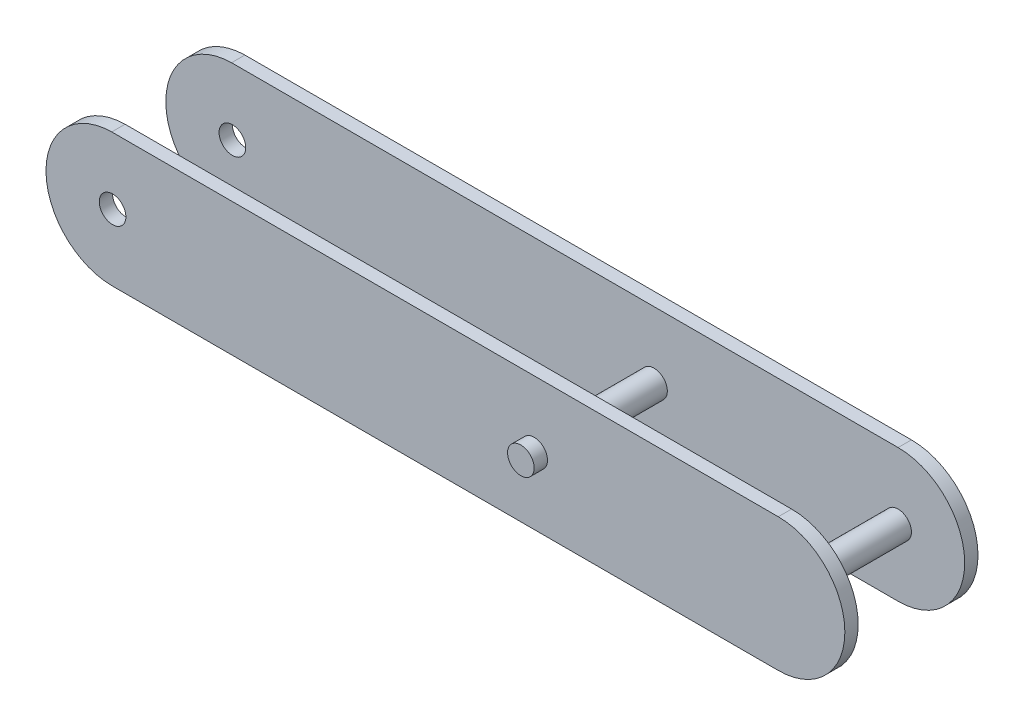
ISO-10303-21;
HEADER;
FILE_DESCRIPTION(('STEP AP214'),'2;1');
FILE_NAME('part.step','',(''),(''),'','','');
FILE_SCHEMA(('AUTOMOTIVE_DESIGN { 1 0 10303 214 1 1 1 1 }'));
ENDSEC;
DATA;
#1=APPLICATION_CONTEXT('core data for automotive mechanical design processes');
#2=APPLICATION_PROTOCOL_DEFINITION('international standard','automotive_design',2000,#1);
#3=PRODUCT_CONTEXT('',#1,'mechanical');
#4=PRODUCT('Part','Part','',(#3));
#5=PRODUCT_RELATED_PRODUCT_CATEGORY('part','',(#4));
#6=PRODUCT_DEFINITION_FORMATION('','',#4);
#7=PRODUCT_DEFINITION_CONTEXT('part definition',#1,'design');
#8=PRODUCT_DEFINITION('design','',#6,#7);
#9=PRODUCT_DEFINITION_SHAPE('','',#8);
#10=(LENGTH_UNIT() NAMED_UNIT(*) SI_UNIT(.MILLI.,.METRE.));
#11=(NAMED_UNIT(*) PLANE_ANGLE_UNIT() SI_UNIT($,.RADIAN.));
#12=(NAMED_UNIT(*) SI_UNIT($,.STERADIAN.) SOLID_ANGLE_UNIT());
#13=UNCERTAINTY_MEASURE_WITH_UNIT(LENGTH_MEASURE(1.E-05),#10,'distance_accuracy_value','');
#14=(GEOMETRIC_REPRESENTATION_CONTEXT(3) GLOBAL_UNCERTAINTY_ASSIGNED_CONTEXT((#13)) GLOBAL_UNIT_ASSIGNED_CONTEXT((#10,
#11,#12)) REPRESENTATION_CONTEXT('',''));
#15=CARTESIAN_POINT('',(0.,0.,0.));
#16=DIRECTION('',(0.,0.,1.));
#17=DIRECTION('',(1.,0.,0.));
#18=AXIS2_PLACEMENT_3D('',#15,#16,#17);
#19=CARTESIAN_POINT('',(-110.,0.,12.));
#20=DIRECTION('',(0.,0.,-1.));
#21=DIRECTION('',(-1.,0.,0.));
#22=AXIS2_PLACEMENT_3D('',#19,#20,#21);
#23=PLANE('',#22);
#24=CARTESIAN_POINT('',(55.,0.,12.));
#25=DIRECTION('',(0.,0.,-1.));
#26=DIRECTION('',(-1.,0.,0.));
#27=AXIS2_PLACEMENT_3D('',#24,#25,#26);
#28=CIRCLE('',#27,3.);
#29=CARTESIAN_POINT('',(52.,0.,12.));
#30=VERTEX_POINT('',#29);
#31=EDGE_CURVE('E11',#30,#30,#28,.T.);
#32=ORIENTED_EDGE('',*,*,#31,.F.);
#33=EDGE_LOOP('',(#32));
#34=FACE_BOUND('',#33,.T.);
#35=CARTESIAN_POINT('',(-95.,0.,12.));
#36=DIRECTION('',(0.,0.,-1.));
#37=DIRECTION('',(-1.,0.,0.));
#38=AXIS2_PLACEMENT_3D('',#35,#36,#37);
#39=CIRCLE('',#38,3.00000000000001);
#40=CARTESIAN_POINT('',(-98.,0.,12.));
#41=VERTEX_POINT('',#40);
#42=EDGE_CURVE('E145',#41,#41,#39,.T.);
#43=ORIENTED_EDGE('',*,*,#42,.F.);
#44=EDGE_LOOP('',(#43));
#45=FACE_BOUND('',#44,.T.);
#46=CARTESIAN_POINT('',(0.,0.,12.));
#47=DIRECTION('',(0.,0.,-1.));
#48=DIRECTION('',(-1.,0.,0.));
#49=AXIS2_PLACEMENT_3D('',#46,#47,#48);
#50=CIRCLE('',#49,3.);
#51=CARTESIAN_POINT('',(-3.,0.,12.));
#52=VERTEX_POINT('',#51);
#53=EDGE_CURVE('E170',#52,#52,#50,.T.);
#54=ORIENTED_EDGE('',*,*,#53,.F.);
#55=EDGE_LOOP('',(#54));
#56=FACE_BOUND('',#55,.T.);
#57=CARTESIAN_POINT('',(55.,0.,12.));
#58=DIRECTION('',(0.,0.,-1.));
#59=DIRECTION('',(-1.,0.,0.));
#60=AXIS2_PLACEMENT_3D('',#57,#58,#59);
#61=CIRCLE('',#60,15.);
#62=CARTESIAN_POINT('',(55.,15.,12.));
#63=VERTEX_POINT('',#62);
#64=CARTESIAN_POINT('',(55.,-15.,12.));
#65=VERTEX_POINT('',#64);
#66=EDGE_CURVE('E266',#63,#65,#61,.T.);
#67=ORIENTED_EDGE('',*,*,#66,.T.);
#68=DIRECTION('',(1.,0.,0.));
#69=VECTOR('',#68,1.);
#70=CARTESIAN_POINT('',(-110.,-15.,12.));
#71=LINE('',#70,#69);
#72=CARTESIAN_POINT('',(-95.1850408959753,-15.,12.));
#73=VERTEX_POINT('',#72);
#74=EDGE_CURVE('E144',#73,#65,#71,.T.);
#75=ORIENTED_EDGE('',*,*,#74,.F.);
#76=CARTESIAN_POINT('',(-95.,0.,12.));
#77=DIRECTION('',(0.,0.,-1.));
#78=DIRECTION('',(-1.,0.,0.));
#79=AXIS2_PLACEMENT_3D('',#76,#77,#78);
#80=CIRCLE('',#79,15.0011412943543);
#81=CARTESIAN_POINT('',(-110.,-0.185040895976278,12.));
#82=VERTEX_POINT('',#81);
#83=EDGE_CURVE('E235',#73,#82,#80,.T.);
#84=ORIENTED_EDGE('',*,*,#83,.T.);
#85=DIRECTION('',(0.,1.,0.));
#86=VECTOR('',#85,1.);
#87=CARTESIAN_POINT('',(-110.,0.,12.));
#88=LINE('',#87,#86);
#89=CARTESIAN_POINT('',(-110.,0.185040895976274,12.));
#90=VERTEX_POINT('',#89);
#91=EDGE_CURVE('E204',#82,#90,#88,.T.);
#92=ORIENTED_EDGE('',*,*,#91,.T.);
#93=CARTESIAN_POINT('',(-95.,0.,12.));
#94=DIRECTION('',(0.,0.,-1.));
#95=DIRECTION('',(-1.,0.,0.));
#96=AXIS2_PLACEMENT_3D('',#93,#94,#95);
#97=CIRCLE('',#96,15.0011412943543);
#98=CARTESIAN_POINT('',(-95.1850408959749,15.,12.));
#99=VERTEX_POINT('',#98);
#100=EDGE_CURVE('E223',#90,#99,#97,.T.);
#101=ORIENTED_EDGE('',*,*,#100,.T.);
#102=DIRECTION('',(1.,0.,0.));
#103=VECTOR('',#102,1.);
#104=CARTESIAN_POINT('',(-110.,15.,12.));
#105=LINE('',#104,#103);
#106=EDGE_CURVE('E155',#99,#63,#105,.T.);
#107=ORIENTED_EDGE('',*,*,#106,.T.);
#108=EDGE_LOOP('',(#67,#75,#84,#92,#101,#107));
#109=FACE_BOUND('',#108,.T.);
#110=ADVANCED_FACE('F34',(#34,#45,#56,#109),#23,.T.);
#111=CARTESIAN_POINT('',(-110.,0.,15.));
#112=DIRECTION('',(0.,0.,1.));
#113=DIRECTION('',(0.,-1.,0.));
#114=AXIS2_PLACEMENT_3D('',#111,#112,#113);
#115=PLANE('',#114);
#116=CARTESIAN_POINT('',(-95.,0.,15.));
#117=DIRECTION('',(0.,0.,1.));
#118=DIRECTION('',(1.,0.,0.));
#119=AXIS2_PLACEMENT_3D('',#116,#117,#118);
#120=CIRCLE('',#119,3.00000000000001);
#121=CARTESIAN_POINT('',(-92.,0.,15.));
#122=VERTEX_POINT('',#121);
#123=EDGE_CURVE('E277',#122,#122,#120,.T.);
#124=ORIENTED_EDGE('',*,*,#123,.F.);
#125=EDGE_LOOP('',(#124));
#126=FACE_BOUND('',#125,.T.);
#127=CARTESIAN_POINT('',(0.,0.,15.));
#128=DIRECTION('',(0.,0.,1.));
#129=DIRECTION('',(0.,-1.,0.));
#130=AXIS2_PLACEMENT_3D('',#127,#128,#129);
#131=CIRCLE('',#130,3.);
#132=CARTESIAN_POINT('',(0.,-3.,15.));
#133=VERTEX_POINT('',#132);
#134=EDGE_CURVE('E167',#133,#133,#131,.T.);
#135=ORIENTED_EDGE('',*,*,#134,.F.);
#136=EDGE_LOOP('',(#135));
#137=FACE_BOUND('',#136,.T.);
#138=DIRECTION('',(1.,0.,0.));
#139=VECTOR('',#138,1.);
#140=CARTESIAN_POINT('',(-110.,-15.,15.));
#141=LINE('',#140,#139);
#142=CARTESIAN_POINT('',(-95.1850408959753,-15.,15.));
#143=VERTEX_POINT('',#142);
#144=CARTESIAN_POINT('',(55.,-15.,15.));
#145=VERTEX_POINT('',#144);
#146=EDGE_CURVE('E142',#143,#145,#141,.T.);
#147=ORIENTED_EDGE('',*,*,#146,.T.);
#148=CARTESIAN_POINT('',(55.,0.,15.));
#149=DIRECTION('',(0.,0.,1.));
#150=DIRECTION('',(1.,0.,0.));
#151=AXIS2_PLACEMENT_3D('',#148,#149,#150);
#152=CIRCLE('',#151,15.);
#153=CARTESIAN_POINT('',(55.,15.,15.));
#154=VERTEX_POINT('',#153);
#155=EDGE_CURVE('E125',#145,#154,#152,.T.);
#156=ORIENTED_EDGE('',*,*,#155,.T.);
#157=DIRECTION('',(1.,0.,0.));
#158=VECTOR('',#157,1.);
#159=CARTESIAN_POINT('',(-110.,15.,15.));
#160=LINE('',#159,#158);
#161=CARTESIAN_POINT('',(-95.1850408959749,15.,15.));
#162=VERTEX_POINT('',#161);
#163=EDGE_CURVE('E151',#162,#154,#160,.T.);
#164=ORIENTED_EDGE('',*,*,#163,.F.);
#165=CARTESIAN_POINT('',(-95.,0.,15.));
#166=DIRECTION('',(0.,0.,1.));
#167=DIRECTION('',(1.,0.,0.));
#168=AXIS2_PLACEMENT_3D('',#165,#166,#167);
#169=CIRCLE('',#168,15.0011412943543);
#170=CARTESIAN_POINT('',(-110.,0.185040895976274,15.));
#171=VERTEX_POINT('',#170);
#172=EDGE_CURVE('E51',#162,#171,#169,.T.);
#173=ORIENTED_EDGE('',*,*,#172,.T.);
#174=DIRECTION('',(0.,-1.,0.));
#175=VECTOR('',#174,1.);
#176=CARTESIAN_POINT('',(-110.,0.,15.));
#177=LINE('',#176,#175);
#178=CARTESIAN_POINT('',(-110.,-0.185040895976278,15.));
#179=VERTEX_POINT('',#178);
#180=EDGE_CURVE('E161',#171,#179,#177,.T.);
#181=ORIENTED_EDGE('',*,*,#180,.T.);
#182=CARTESIAN_POINT('',(-95.,0.,15.));
#183=DIRECTION('',(0.,0.,1.));
#184=DIRECTION('',(1.,0.,0.));
#185=AXIS2_PLACEMENT_3D('',#182,#183,#184);
#186=CIRCLE('',#185,15.0011412943543);
#187=EDGE_CURVE('E150',#179,#143,#186,.T.);
#188=ORIENTED_EDGE('',*,*,#187,.T.);
#189=EDGE_LOOP('',(#147,#156,#164,#173,#181,#188));
#190=FACE_BOUND('',#189,.T.);
#191=ADVANCED_FACE('F148',(#126,#137,#190),#115,.T.);
#192=CARTESIAN_POINT('',(-110.,0.,-12.));
#193=DIRECTION('',(0.,0.,-1.));
#194=DIRECTION('',(-1.,0.,0.));
#195=AXIS2_PLACEMENT_3D('',#192,#193,#194);
#196=PLANE('',#195);
#197=CARTESIAN_POINT('',(55.,0.,-12.));
#198=DIRECTION('',(0.,0.,-1.));
#199=DIRECTION('',(-1.,0.,0.));
#200=AXIS2_PLACEMENT_3D('',#197,#198,#199);
#201=CIRCLE('',#200,3.);
#202=CARTESIAN_POINT('',(52.,0.,-12.));
#203=VERTEX_POINT('',#202);
#204=EDGE_CURVE('E279',#203,#203,#201,.T.);
#205=ORIENTED_EDGE('',*,*,#204,.T.);
#206=EDGE_LOOP('',(#205));
#207=FACE_BOUND('',#206,.T.);
#208=CARTESIAN_POINT('',(-95.,0.,-12.));
#209=DIRECTION('',(0.,0.,-1.));
#210=DIRECTION('',(-1.,0.,0.));
#211=AXIS2_PLACEMENT_3D('',#208,#209,#210);
#212=CIRCLE('',#211,3.00000000000001);
#213=CARTESIAN_POINT('',(-98.,0.,-12.));
#214=VERTEX_POINT('',#213);
#215=EDGE_CURVE('E274',#214,#214,#212,.T.);
#216=ORIENTED_EDGE('',*,*,#215,.T.);
#217=EDGE_LOOP('',(#216));
#218=FACE_BOUND('',#217,.T.);
#219=CARTESIAN_POINT('',(0.,0.,-12.));
#220=DIRECTION('',(0.,0.,-1.));
#221=DIRECTION('',(-1.,0.,0.));
#222=AXIS2_PLACEMENT_3D('',#219,#220,#221);
#223=CIRCLE('',#222,3.);
#224=CARTESIAN_POINT('',(-3.,0.,-12.));
#225=VERTEX_POINT('',#224);
#226=EDGE_CURVE('E176',#225,#225,#223,.T.);
#227=ORIENTED_EDGE('',*,*,#226,.T.);
#228=EDGE_LOOP('',(#227));
#229=FACE_BOUND('',#228,.T.);
#230=DIRECTION('',(1.,0.,0.));
#231=VECTOR('',#230,1.);
#232=CARTESIAN_POINT('',(-110.,-15.,-12.));
#233=LINE('',#232,#231);
#234=CARTESIAN_POINT('',(-95.1850408959753,-15.,-12.));
#235=VERTEX_POINT('',#234);
#236=CARTESIAN_POINT('',(55.,-15.,-12.));
#237=VERTEX_POINT('',#236);
#238=EDGE_CURVE('E207',#235,#237,#233,.T.);
#239=ORIENTED_EDGE('',*,*,#238,.T.);
#240=CARTESIAN_POINT('',(55.,0.,-12.));
#241=DIRECTION('',(0.,0.,-1.));
#242=DIRECTION('',(-1.,0.,0.));
#243=AXIS2_PLACEMENT_3D('',#240,#241,#242);
#244=CIRCLE('',#243,15.);
#245=CARTESIAN_POINT('',(55.,15.,-12.));
#246=VERTEX_POINT('',#245);
#247=EDGE_CURVE('E268',#246,#237,#244,.T.);
#248=ORIENTED_EDGE('',*,*,#247,.F.);
#249=DIRECTION('',(1.,0.,0.));
#250=VECTOR('',#249,1.);
#251=CARTESIAN_POINT('',(-110.,15.,-12.));
#252=LINE('',#251,#250);
#253=CARTESIAN_POINT('',(-95.185040895975,15.,-12.));
#254=VERTEX_POINT('',#253);
#255=EDGE_CURVE('E201',#254,#246,#252,.T.);
#256=ORIENTED_EDGE('',*,*,#255,.F.);
#257=CARTESIAN_POINT('',(-95.,0.,-12.));
#258=DIRECTION('',(0.,0.,-1.));
#259=DIRECTION('',(-1.,0.,0.));
#260=AXIS2_PLACEMENT_3D('',#257,#258,#259);
#261=CIRCLE('',#260,15.0011412943543);
#262=CARTESIAN_POINT('',(-110.,0.185040895976274,-12.));
#263=VERTEX_POINT('',#262);
#264=EDGE_CURVE('E59',#263,#254,#261,.T.);
#265=ORIENTED_EDGE('',*,*,#264,.F.);
#266=DIRECTION('',(0.,1.,0.));
#267=VECTOR('',#266,1.);
#268=CARTESIAN_POINT('',(-110.,0.,-12.));
#269=LINE('',#268,#267);
#270=CARTESIAN_POINT('',(-110.,-0.185040895976278,-12.));
#271=VERTEX_POINT('',#270);
#272=EDGE_CURVE('E237',#271,#263,#269,.T.);
#273=ORIENTED_EDGE('',*,*,#272,.F.);
#274=CARTESIAN_POINT('',(-95.,0.,-12.));
#275=DIRECTION('',(0.,0.,-1.));
#276=DIRECTION('',(-1.,0.,0.));
#277=AXIS2_PLACEMENT_3D('',#274,#275,#276);
#278=CIRCLE('',#277,15.0011412943543);
#279=EDGE_CURVE('E233',#235,#271,#278,.T.);
#280=ORIENTED_EDGE('',*,*,#279,.F.);
#281=EDGE_LOOP('',(#239,#248,#256,#265,#273,#280));
#282=FACE_BOUND('',#281,.T.);
#283=ADVANCED_FACE('F255',(#207,#218,#229,#282),#196,.F.);
#284=CARTESIAN_POINT('',(-110.,0.,-15.));
#285=DIRECTION('',(0.,0.,1.));
#286=DIRECTION('',(0.,-1.,0.));
#287=AXIS2_PLACEMENT_3D('',#284,#285,#286);
#288=PLANE('',#287);
#289=CARTESIAN_POINT('',(-95.,0.,-15.));
#290=DIRECTION('',(0.,0.,1.));
#291=DIRECTION('',(0.,-1.,0.));
#292=AXIS2_PLACEMENT_3D('',#289,#290,#291);
#293=CIRCLE('',#292,3.00000000000001);
#294=CARTESIAN_POINT('',(-95.,-3.00000000000001,-15.));
#295=VERTEX_POINT('',#294);
#296=EDGE_CURVE('E38',#295,#295,#293,.T.);
#297=ORIENTED_EDGE('',*,*,#296,.T.);
#298=EDGE_LOOP('',(#297));
#299=FACE_BOUND('',#298,.T.);
#300=CARTESIAN_POINT('',(0.,0.,-15.));
#301=DIRECTION('',(0.,0.,1.));
#302=DIRECTION('',(0.,-1.,0.));
#303=AXIS2_PLACEMENT_3D('',#300,#301,#302);
#304=CIRCLE('',#303,3.);
#305=CARTESIAN_POINT('',(0.,-3.,-15.));
#306=VERTEX_POINT('',#305);
#307=EDGE_CURVE('E173',#306,#306,#304,.T.);
#308=ORIENTED_EDGE('',*,*,#307,.T.);
#309=EDGE_LOOP('',(#308));
#310=FACE_BOUND('',#309,.T.);
#311=CARTESIAN_POINT('',(55.,0.,-15.));
#312=DIRECTION('',(0.,0.,1.));
#313=DIRECTION('',(0.,-1.,0.));
#314=AXIS2_PLACEMENT_3D('',#311,#312,#313);
#315=CIRCLE('',#314,15.);
#316=CARTESIAN_POINT('',(55.,-15.,-15.));
#317=VERTEX_POINT('',#316);
#318=CARTESIAN_POINT('',(55.,15.,-15.));
#319=VERTEX_POINT('',#318);
#320=EDGE_CURVE('E248',#317,#319,#315,.T.);
#321=ORIENTED_EDGE('',*,*,#320,.F.);
#322=DIRECTION('',(1.,0.,0.));
#323=VECTOR('',#322,1.);
#324=CARTESIAN_POINT('',(-110.,-15.,-15.));
#325=LINE('',#324,#323);
#326=CARTESIAN_POINT('',(-95.1850408959753,-15.,-15.));
#327=VERTEX_POINT('',#326);
#328=EDGE_CURVE('E202',#327,#317,#325,.T.);
#329=ORIENTED_EDGE('',*,*,#328,.F.);
#330=CARTESIAN_POINT('',(-95.,0.,-15.));
#331=DIRECTION('',(0.,0.,1.));
#332=DIRECTION('',(0.,-1.,0.));
#333=AXIS2_PLACEMENT_3D('',#330,#331,#332);
#334=CIRCLE('',#333,15.0011412943543);
#335=CARTESIAN_POINT('',(-110.,-0.185040895976278,-15.));
#336=VERTEX_POINT('',#335);
#337=EDGE_CURVE('E231',#336,#327,#334,.T.);
#338=ORIENTED_EDGE('',*,*,#337,.F.);
#339=DIRECTION('',(0.,-1.,0.));
#340=VECTOR('',#339,1.);
#341=CARTESIAN_POINT('',(-110.,0.,-15.));
#342=LINE('',#341,#340);
#343=CARTESIAN_POINT('',(-110.,0.185040895976274,-15.));
#344=VERTEX_POINT('',#343);
#345=EDGE_CURVE('E195',#344,#336,#342,.T.);
#346=ORIENTED_EDGE('',*,*,#345,.F.);
#347=CARTESIAN_POINT('',(-95.,0.,-15.));
#348=DIRECTION('',(0.,0.,1.));
#349=DIRECTION('',(0.,-1.,0.));
#350=AXIS2_PLACEMENT_3D('',#347,#348,#349);
#351=CIRCLE('',#350,15.0011412943543);
#352=CARTESIAN_POINT('',(-95.1850408959749,15.,-15.));
#353=VERTEX_POINT('',#352);
#354=EDGE_CURVE('E183',#353,#344,#351,.T.);
#355=ORIENTED_EDGE('',*,*,#354,.F.);
#356=DIRECTION('',(1.,0.,0.));
#357=VECTOR('',#356,1.);
#358=CARTESIAN_POINT('',(-110.,15.,-15.));
#359=LINE('',#358,#357);
#360=EDGE_CURVE('E193',#353,#319,#359,.T.);
#361=ORIENTED_EDGE('',*,*,#360,.T.);
#362=EDGE_LOOP('',(#321,#329,#338,#346,#355,#361));
#363=FACE_BOUND('',#362,.T.);
#364=ADVANCED_FACE('F192',(#299,#310,#363),#288,.F.);
#365=CARTESIAN_POINT('',(-110.,-15.,0.));
#366=DIRECTION('',(0.,-1.,0.));
#367=DIRECTION('',(0.,0.,-1.));
#368=AXIS2_PLACEMENT_3D('',#365,#366,#367);
#369=PLANE('',#368);
#370=ORIENTED_EDGE('',*,*,#74,.T.);
#371=DIRECTION('',(0.,0.,1.));
#372=VECTOR('',#371,1.);
#373=CARTESIAN_POINT('',(55.,-15.,-55.));
#374=LINE('',#373,#372);
#375=EDGE_CURVE('E128',#65,#145,#374,.T.);
#376=ORIENTED_EDGE('',*,*,#375,.T.);
#377=ORIENTED_EDGE('',*,*,#146,.F.);
#378=DIRECTION('',(0.,0.,1.));
#379=VECTOR('',#378,1.);
#380=CARTESIAN_POINT('',(-95.1850408959753,-15.,-55.));
#381=LINE('',#380,#379);
#382=EDGE_CURVE('E222',#73,#143,#381,.T.);
#383=ORIENTED_EDGE('',*,*,#382,.F.);
#384=EDGE_LOOP('',(#370,#376,#377,#383));
#385=FACE_BOUND('',#384,.T.);
#386=ADVANCED_FACE('F140',(#385),#369,.T.);
#387=CARTESIAN_POINT('',(-110.,15.,0.));
#388=DIRECTION('',(0.,-1.,0.));
#389=DIRECTION('',(0.,0.,-1.));
#390=AXIS2_PLACEMENT_3D('',#387,#388,#389);
#391=PLANE('',#390);
#392=DIRECTION('',(0.,0.,1.));
#393=VECTOR('',#392,1.);
#394=CARTESIAN_POINT('',(55.,15.,-55.));
#395=LINE('',#394,#393);
#396=EDGE_CURVE('E200',#319,#246,#395,.T.);
#397=ORIENTED_EDGE('',*,*,#396,.F.);
#398=ORIENTED_EDGE('',*,*,#360,.F.);
#399=DIRECTION('',(0.,0.,1.));
#400=VECTOR('',#399,1.);
#401=CARTESIAN_POINT('',(-95.185040895975,15.,-55.));
#402=LINE('',#401,#400);
#403=EDGE_CURVE('E43',#254,#353,#402,.F.);
#404=ORIENTED_EDGE('',*,*,#403,.F.);
#405=ORIENTED_EDGE('',*,*,#255,.T.);
#406=EDGE_LOOP('',(#397,#398,#404,#405));
#407=FACE_BOUND('',#406,.T.);
#408=ADVANCED_FACE('F199',(#407),#391,.F.);
#409=CARTESIAN_POINT('',(-110.,0.,0.));
#410=DIRECTION('',(1.,0.,0.));
#411=DIRECTION('',(0.,0.,-1.));
#412=AXIS2_PLACEMENT_3D('',#409,#410,#411);
#413=PLANE('',#412);
#414=DIRECTION('',(0.,0.,1.));
#415=VECTOR('',#414,1.);
#416=CARTESIAN_POINT('',(-110.,0.185040895976274,-55.));
#417=LINE('',#416,#415);
#418=EDGE_CURVE('E263',#90,#171,#417,.T.);
#419=ORIENTED_EDGE('',*,*,#418,.F.);
#420=ORIENTED_EDGE('',*,*,#91,.F.);
#421=DIRECTION('',(0.,0.,1.));
#422=VECTOR('',#421,1.);
#423=CARTESIAN_POINT('',(-110.,-0.185040895976278,-55.));
#424=LINE('',#423,#422);
#425=EDGE_CURVE('E220',#82,#179,#424,.T.);
#426=ORIENTED_EDGE('',*,*,#425,.T.);
#427=ORIENTED_EDGE('',*,*,#180,.F.);
#428=EDGE_LOOP('',(#419,#420,#426,#427));
#429=FACE_BOUND('',#428,.T.);
#430=ADVANCED_FACE('F226',(#429),#413,.F.);
#431=CARTESIAN_POINT('',(-110.,0.,0.));
#432=DIRECTION('',(1.,0.,0.));
#433=DIRECTION('',(0.,0.,-1.));
#434=AXIS2_PLACEMENT_3D('',#431,#432,#433);
#435=PLANE('',#434);
#436=EDGE_CURVE('E196',#344,#263,#417,.T.);
#437=ORIENTED_EDGE('',*,*,#436,.F.);
#438=ORIENTED_EDGE('',*,*,#345,.T.);
#439=DIRECTION('',(0.,0.,1.));
#440=VECTOR('',#439,1.);
#441=CARTESIAN_POINT('',(-110.,-0.185040895976278,-55.));
#442=LINE('',#441,#440);
#443=EDGE_CURVE('E179',#271,#336,#442,.F.);
#444=ORIENTED_EDGE('',*,*,#443,.F.);
#445=ORIENTED_EDGE('',*,*,#272,.T.);
#446=EDGE_LOOP('',(#437,#438,#444,#445));
#447=FACE_BOUND('',#446,.T.);
#448=ADVANCED_FACE('F241',(#447),#435,.F.);
#449=CARTESIAN_POINT('',(-110.,15.,0.));
#450=DIRECTION('',(0.,1.,0.));
#451=DIRECTION('',(0.,0.,1.));
#452=AXIS2_PLACEMENT_3D('',#449,#450,#451);
#453=PLANE('',#452);
#454=EDGE_CURVE('E131',#63,#154,#395,.T.);
#455=ORIENTED_EDGE('',*,*,#454,.F.);
#456=ORIENTED_EDGE('',*,*,#106,.F.);
#457=DIRECTION('',(0.,0.,1.));
#458=VECTOR('',#457,1.);
#459=CARTESIAN_POINT('',(-95.1850408959749,15.,-55.));
#460=LINE('',#459,#458);
#461=EDGE_CURVE('E261',#99,#162,#460,.T.);
#462=ORIENTED_EDGE('',*,*,#461,.T.);
#463=ORIENTED_EDGE('',*,*,#163,.T.);
#464=EDGE_LOOP('',(#455,#456,#462,#463));
#465=FACE_BOUND('',#464,.T.);
#466=ADVANCED_FACE('F309',(#465),#453,.T.);
#467=CARTESIAN_POINT('',(-110.,-15.,0.));
#468=DIRECTION('',(0.,1.,0.));
#469=DIRECTION('',(0.,0.,1.));
#470=AXIS2_PLACEMENT_3D('',#467,#468,#469);
#471=PLANE('',#470);
#472=ORIENTED_EDGE('',*,*,#328,.T.);
#473=EDGE_CURVE('E136',#317,#237,#374,.T.);
#474=ORIENTED_EDGE('',*,*,#473,.T.);
#475=ORIENTED_EDGE('',*,*,#238,.F.);
#476=EDGE_CURVE('E228',#327,#235,#381,.T.);
#477=ORIENTED_EDGE('',*,*,#476,.F.);
#478=EDGE_LOOP('',(#472,#474,#475,#477));
#479=FACE_BOUND('',#478,.T.);
#480=ADVANCED_FACE('F252',(#479),#471,.F.);
#481=CARTESIAN_POINT('',(0.,0.,18.));
#482=DIRECTION('',(0.,0.,-1.));
#483=DIRECTION('',(-1.,0.,0.));
#484=AXIS2_PLACEMENT_3D('',#481,#482,#483);
#485=CYLINDRICAL_SURFACE('',#484,3.);
#486=ORIENTED_EDGE('',*,*,#53,.T.);
#487=EDGE_LOOP('',(#486));
#488=FACE_BOUND('',#487,.T.);
#489=ORIENTED_EDGE('',*,*,#226,.F.);
#490=EDGE_LOOP('',(#489));
#491=FACE_BOUND('',#490,.T.);
#492=ADVANCED_FACE('F321',(#488,#491),#485,.T.);
#493=CARTESIAN_POINT('',(0.,0.,-18.));
#494=DIRECTION('',(0.,0.,1.));
#495=DIRECTION('',(1.,0.,0.));
#496=AXIS2_PLACEMENT_3D('',#493,#494,#495);
#497=CIRCLE('',#496,3.);
#498=CARTESIAN_POINT('',(3.,0.,-18.));
#499=VERTEX_POINT('',#498);
#500=EDGE_CURVE('E153',#499,#499,#497,.T.);
#501=ORIENTED_EDGE('',*,*,#500,.T.);
#502=EDGE_LOOP('',(#501));
#503=FACE_BOUND('',#502,.T.);
#504=ORIENTED_EDGE('',*,*,#307,.F.);
#505=EDGE_LOOP('',(#504));
#506=FACE_BOUND('',#505,.T.);
#507=ADVANCED_FACE('F319',(#503,#506),#485,.T.);
#508=CARTESIAN_POINT('',(0.,0.,18.));
#509=DIRECTION('',(0.,0.,1.));
#510=DIRECTION('',(1.,0.,0.));
#511=AXIS2_PLACEMENT_3D('',#508,#509,#510);
#512=CIRCLE('',#511,3.);
#513=CARTESIAN_POINT('',(3.,0.,18.));
#514=VERTEX_POINT('',#513);
#515=EDGE_CURVE('E164',#514,#514,#512,.T.);
#516=ORIENTED_EDGE('',*,*,#515,.F.);
#517=EDGE_LOOP('',(#516));
#518=FACE_BOUND('',#517,.T.);
#519=ORIENTED_EDGE('',*,*,#134,.T.);
#520=EDGE_LOOP('',(#519));
#521=FACE_BOUND('',#520,.T.);
#522=ADVANCED_FACE('F36',(#518,#521),#485,.T.);
#523=CARTESIAN_POINT('',(0.,0.,18.));
#524=DIRECTION('',(0.,0.,1.));
#525=DIRECTION('',(1.,0.,0.));
#526=AXIS2_PLACEMENT_3D('',#523,#524,#525);
#527=PLANE('',#526);
#528=ORIENTED_EDGE('',*,*,#515,.T.);
#529=EDGE_LOOP('',(#528));
#530=FACE_BOUND('',#529,.T.);
#531=ADVANCED_FACE('F312',(#530),#527,.T.);
#532=CARTESIAN_POINT('',(0.,0.,-18.));
#533=DIRECTION('',(0.,0.,1.));
#534=DIRECTION('',(1.,0.,0.));
#535=AXIS2_PLACEMENT_3D('',#532,#533,#534);
#536=PLANE('',#535);
#537=ORIENTED_EDGE('',*,*,#500,.F.);
#538=EDGE_LOOP('',(#537));
#539=FACE_BOUND('',#538,.T.);
#540=ADVANCED_FACE('F310',(#539),#536,.F.);
#541=CARTESIAN_POINT('',(-95.,0.,-55.));
#542=DIRECTION('',(0.,0.,1.));
#543=DIRECTION('',(1.,0.,0.));
#544=AXIS2_PLACEMENT_3D('',#541,#542,#543);
#545=CYLINDRICAL_SURFACE('',#544,15.0011412943543);
#546=ORIENTED_EDGE('',*,*,#279,.T.);
#547=ORIENTED_EDGE('',*,*,#443,.T.);
#548=ORIENTED_EDGE('',*,*,#337,.T.);
#549=ORIENTED_EDGE('',*,*,#476,.T.);
#550=EDGE_LOOP('',(#546,#547,#548,#549));
#551=FACE_BOUND('',#550,.T.);
#552=ADVANCED_FACE('F244',(#551),#545,.T.);
#553=ORIENTED_EDGE('',*,*,#382,.T.);
#554=ORIENTED_EDGE('',*,*,#187,.F.);
#555=ORIENTED_EDGE('',*,*,#425,.F.);
#556=ORIENTED_EDGE('',*,*,#83,.F.);
#557=EDGE_LOOP('',(#553,#554,#555,#556));
#558=FACE_BOUND('',#557,.T.);
#559=ADVANCED_FACE('F219',(#558),#545,.T.);
#560=CARTESIAN_POINT('',(-95.,0.,-55.));
#561=DIRECTION('',(0.,0.,1.));
#562=DIRECTION('',(1.,0.,0.));
#563=AXIS2_PLACEMENT_3D('',#560,#561,#562);
#564=CYLINDRICAL_SURFACE('',#563,15.0011412943543);
#565=ORIENTED_EDGE('',*,*,#264,.T.);
#566=ORIENTED_EDGE('',*,*,#403,.T.);
#567=ORIENTED_EDGE('',*,*,#354,.T.);
#568=ORIENTED_EDGE('',*,*,#436,.T.);
#569=EDGE_LOOP('',(#565,#566,#567,#568));
#570=FACE_BOUND('',#569,.T.);
#571=ADVANCED_FACE('F182',(#570),#564,.T.);
#572=ORIENTED_EDGE('',*,*,#418,.T.);
#573=ORIENTED_EDGE('',*,*,#172,.F.);
#574=ORIENTED_EDGE('',*,*,#461,.F.);
#575=ORIENTED_EDGE('',*,*,#100,.F.);
#576=EDGE_LOOP('',(#572,#573,#574,#575));
#577=FACE_BOUND('',#576,.T.);
#578=ADVANCED_FACE('F364',(#577),#564,.T.);
#579=CARTESIAN_POINT('',(55.,0.,-55.));
#580=DIRECTION('',(0.,0.,1.));
#581=DIRECTION('',(1.,0.,0.));
#582=AXIS2_PLACEMENT_3D('',#579,#580,#581);
#583=CYLINDRICAL_SURFACE('',#582,15.);
#584=ORIENTED_EDGE('',*,*,#247,.T.);
#585=ORIENTED_EDGE('',*,*,#473,.F.);
#586=ORIENTED_EDGE('',*,*,#320,.T.);
#587=ORIENTED_EDGE('',*,*,#396,.T.);
#588=EDGE_LOOP('',(#584,#585,#586,#587));
#589=FACE_BOUND('',#588,.T.);
#590=ADVANCED_FACE('F365',(#589),#583,.T.);
#591=ORIENTED_EDGE('',*,*,#454,.T.);
#592=ORIENTED_EDGE('',*,*,#155,.F.);
#593=ORIENTED_EDGE('',*,*,#375,.F.);
#594=ORIENTED_EDGE('',*,*,#66,.F.);
#595=EDGE_LOOP('',(#591,#592,#593,#594));
#596=FACE_BOUND('',#595,.T.);
#597=ADVANCED_FACE('F127',(#596),#583,.T.);
#598=CARTESIAN_POINT('',(-95.,0.,-55.));
#599=DIRECTION('',(0.,0.,1.));
#600=DIRECTION('',(1.,0.,0.));
#601=AXIS2_PLACEMENT_3D('',#598,#599,#600);
#602=CYLINDRICAL_SURFACE('',#601,3.00000000000001);
#603=ORIENTED_EDGE('',*,*,#296,.F.);
#604=EDGE_LOOP('',(#603));
#605=FACE_BOUND('',#604,.T.);
#606=ORIENTED_EDGE('',*,*,#215,.F.);
#607=EDGE_LOOP('',(#606));
#608=FACE_BOUND('',#607,.T.);
#609=ADVANCED_FACE('F294',(#605,#608),#602,.F.);
#610=ORIENTED_EDGE('',*,*,#42,.T.);
#611=EDGE_LOOP('',(#610));
#612=FACE_BOUND('',#611,.T.);
#613=ORIENTED_EDGE('',*,*,#123,.T.);
#614=EDGE_LOOP('',(#613));
#615=FACE_BOUND('',#614,.T.);
#616=ADVANCED_FACE('F288',(#612,#615),#602,.F.);
#617=CARTESIAN_POINT('',(55.,0.,-15.));
#618=DIRECTION('',(0.,0.,1.));
#619=DIRECTION('',(1.,0.,0.));
#620=AXIS2_PLACEMENT_3D('',#617,#618,#619);
#621=CYLINDRICAL_SURFACE('',#620,3.);
#622=ORIENTED_EDGE('',*,*,#31,.T.);
#623=EDGE_LOOP('',(#622));
#624=FACE_BOUND('',#623,.T.);
#625=ORIENTED_EDGE('',*,*,#204,.F.);
#626=EDGE_LOOP('',(#625));
#627=FACE_BOUND('',#626,.T.);
#628=ADVANCED_FACE('F286',(#624,#627),#621,.T.);
#629=CLOSED_SHELL('',(#110,#191,#283,#364,#386,#408,#430,#448,#466,#480,#492,#507,#522,#531,
#540,#552,#559,#571,#578,#590,#597,#609,#616,#628));
#630=MANIFOLD_SOLID_BREP('B2',#629);
#631=ADVANCED_BREP_SHAPE_REPRESENTATION('',(#18,#630),#14);
#632=SHAPE_DEFINITION_REPRESENTATION(#9,#631);
ENDSEC;
END-ISO-10303-21;
